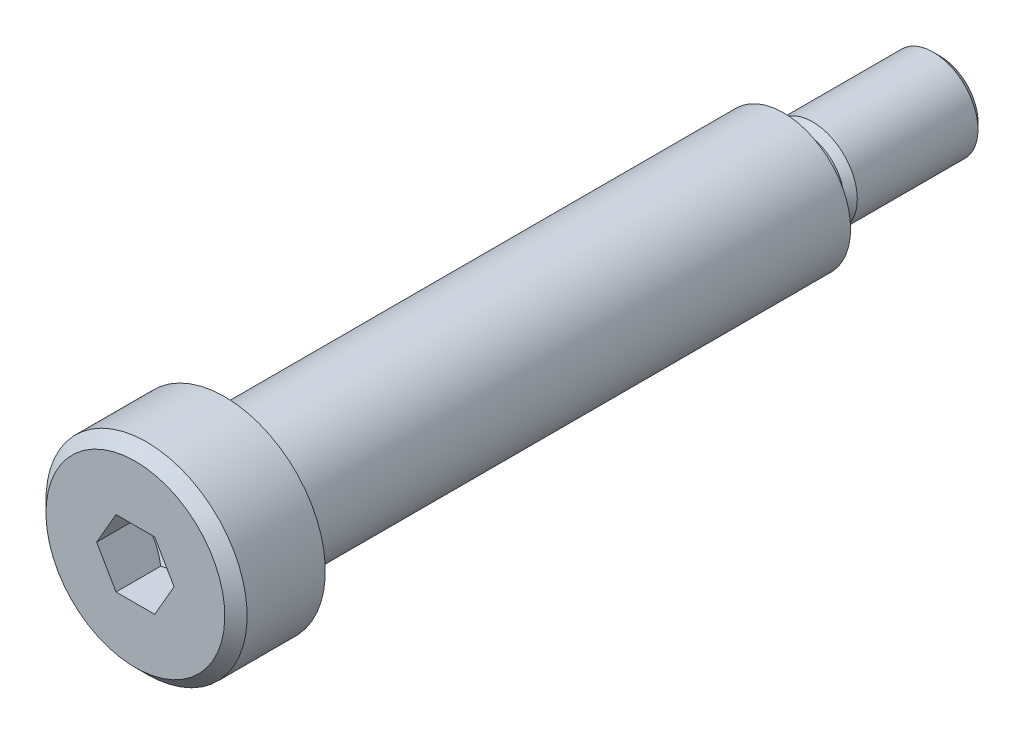
ISO-10303-21;
HEADER;
FILE_DESCRIPTION(('STEP AP214'),'2;1');
FILE_NAME('part.step','',(''),(''),'','','');
FILE_SCHEMA(('AUTOMOTIVE_DESIGN { 1 0 10303 214 1 1 1 1 }'));
ENDSEC;
DATA;
#1=APPLICATION_CONTEXT('core data for automotive mechanical design processes');
#2=APPLICATION_PROTOCOL_DEFINITION('international standard','automotive_design',2000,#1);
#3=PRODUCT_CONTEXT('',#1,'mechanical');
#4=PRODUCT('Part','Part','',(#3));
#5=PRODUCT_RELATED_PRODUCT_CATEGORY('part','',(#4));
#6=PRODUCT_DEFINITION_FORMATION('','',#4);
#7=PRODUCT_DEFINITION_CONTEXT('part definition',#1,'design');
#8=PRODUCT_DEFINITION('design','',#6,#7);
#9=PRODUCT_DEFINITION_SHAPE('','',#8);
#10=(LENGTH_UNIT() NAMED_UNIT(*) SI_UNIT(.MILLI.,.METRE.));
#11=(NAMED_UNIT(*) PLANE_ANGLE_UNIT() SI_UNIT($,.RADIAN.));
#12=(NAMED_UNIT(*) SI_UNIT($,.STERADIAN.) SOLID_ANGLE_UNIT());
#13=UNCERTAINTY_MEASURE_WITH_UNIT(LENGTH_MEASURE(1.E-05),#10,'distance_accuracy_value','');
#14=(GEOMETRIC_REPRESENTATION_CONTEXT(3) GLOBAL_UNCERTAINTY_ASSIGNED_CONTEXT((#13)) GLOBAL_UNIT_ASSIGNED_CONTEXT((#10,
#11,#12)) REPRESENTATION_CONTEXT('',''));
#15=CARTESIAN_POINT('',(0.,0.,0.));
#16=DIRECTION('',(0.,0.,1.));
#17=DIRECTION('',(1.,0.,0.));
#18=AXIS2_PLACEMENT_3D('',#15,#16,#17);
#19=CARTESIAN_POINT('',(0.,0.,25.));
#20=DIRECTION('',(0.,0.,-1.));
#21=DIRECTION('',(0.,-1.,0.));
#22=AXIS2_PLACEMENT_3D('',#19,#20,#21);
#23=PLANE('',#22);
#24=CARTESIAN_POINT('',(0.,0.,25.));
#25=DIRECTION('',(0.,0.,1.));
#26=DIRECTION('',(1.,0.,0.));
#27=AXIS2_PLACEMENT_3D('',#24,#25,#26);
#28=CIRCLE('',#27,3.);
#29=CARTESIAN_POINT('',(3.,0.,25.));
#30=VERTEX_POINT('',#29);
#31=EDGE_CURVE('E175',#30,#30,#28,.T.);
#32=ORIENTED_EDGE('',*,*,#31,.T.);
#33=EDGE_LOOP('',(#32));
#34=FACE_BOUND('',#33,.T.);
#35=CARTESIAN_POINT('',(0.,0.,25.));
#36=DIRECTION('',(0.,0.,-1.));
#37=DIRECTION('',(0.,1.,0.));
#38=AXIS2_PLACEMENT_3D('',#35,#36,#37);
#39=CIRCLE('',#38,4.5);
#40=CARTESIAN_POINT('',(0.,4.5,25.));
#41=VERTEX_POINT('',#40);
#42=EDGE_CURVE('E10',#41,#41,#39,.T.);
#43=ORIENTED_EDGE('',*,*,#42,.T.);
#44=EDGE_LOOP('',(#43));
#45=FACE_BOUND('',#44,.T.);
#46=ADVANCED_FACE('F16',(#34,#45),#23,.T.);
#47=CARTESIAN_POINT('',(0.,0.,29.));
#48=DIRECTION('',(0.,0.,1.));
#49=DIRECTION('',(0.,-1.,0.));
#50=AXIS2_PLACEMENT_3D('',#47,#48,#49);
#51=PLANE('',#50);
#52=DIRECTION('',(-1.,0.,0.));
#53=VECTOR('',#52,1.);
#54=CARTESIAN_POINT('',(0.,-1.5,29.));
#55=LINE('',#54,#53);
#56=CARTESIAN_POINT('',(0.866025403784437,-1.5,29.));
#57=VERTEX_POINT('',#56);
#58=CARTESIAN_POINT('',(-0.866025403784438,-1.5,29.));
#59=VERTEX_POINT('',#58);
#60=EDGE_CURVE('E146',#57,#59,#55,.T.);
#61=ORIENTED_EDGE('',*,*,#60,.T.);
#62=DIRECTION('',(-0.5,0.866025403784439,0.));
#63=VECTOR('',#62,1.);
#64=CARTESIAN_POINT('',(-1.29903810567666,-0.75,29.));
#65=LINE('',#64,#63);
#66=CARTESIAN_POINT('',(-1.73205080756888,0.,29.));
#67=VERTEX_POINT('',#66);
#68=EDGE_CURVE('E151',#59,#67,#65,.T.);
#69=ORIENTED_EDGE('',*,*,#68,.T.);
#70=DIRECTION('',(0.5,0.866025403784438,0.));
#71=VECTOR('',#70,1.);
#72=CARTESIAN_POINT('',(-1.29903810567666,0.75,29.));
#73=LINE('',#72,#71);
#74=CARTESIAN_POINT('',(-0.866025403784437,1.5,29.));
#75=VERTEX_POINT('',#74);
#76=EDGE_CURVE('E152',#67,#75,#73,.T.);
#77=ORIENTED_EDGE('',*,*,#76,.T.);
#78=DIRECTION('',(1.,0.,0.));
#79=VECTOR('',#78,1.);
#80=CARTESIAN_POINT('',(0.,1.5,29.));
#81=LINE('',#80,#79);
#82=CARTESIAN_POINT('',(0.866025403784441,1.5,29.));
#83=VERTEX_POINT('',#82);
#84=EDGE_CURVE('E238',#75,#83,#81,.T.);
#85=ORIENTED_EDGE('',*,*,#84,.T.);
#86=DIRECTION('',(0.5,-0.866025403784439,0.));
#87=VECTOR('',#86,1.);
#88=CARTESIAN_POINT('',(1.29903810567666,0.75,29.));
#89=LINE('',#88,#87);
#90=CARTESIAN_POINT('',(1.73205080756888,0.,29.));
#91=VERTEX_POINT('',#90);
#92=EDGE_CURVE('E229',#83,#91,#89,.T.);
#93=ORIENTED_EDGE('',*,*,#92,.T.);
#94=DIRECTION('',(-0.5,-0.866025403784438,0.));
#95=VECTOR('',#94,1.);
#96=CARTESIAN_POINT('',(1.29903810567666,-0.75,29.));
#97=LINE('',#96,#95);
#98=EDGE_CURVE('E220',#91,#57,#97,.T.);
#99=ORIENTED_EDGE('',*,*,#98,.T.);
#100=EDGE_LOOP('',(#61,#69,#77,#85,#93,#99));
#101=FACE_BOUND('',#100,.T.);
#102=CARTESIAN_POINT('',(0.,0.,29.));
#103=DIRECTION('',(0.,0.,-1.));
#104=DIRECTION('',(0.,-1.,0.));
#105=AXIS2_PLACEMENT_3D('',#102,#103,#104);
#106=CIRCLE('',#105,4.);
#107=CARTESIAN_POINT('',(0.,4.,29.));
#108=VERTEX_POINT('',#107);
#109=EDGE_CURVE('E24',#108,#108,#106,.T.);
#110=ORIENTED_EDGE('',*,*,#109,.F.);
#111=EDGE_LOOP('',(#110));
#112=FACE_BOUND('',#111,.T.);
#113=ADVANCED_FACE('F354',(#101,#112),#51,.T.);
#114=CARTESIAN_POINT('',(0.,0.,27.));
#115=DIRECTION('',(0.,0.,-1.));
#116=DIRECTION('',(0.,1.,0.));
#117=AXIS2_PLACEMENT_3D('',#114,#115,#116);
#118=CYLINDRICAL_SURFACE('',#117,4.5);
#119=CARTESIAN_POINT('',(0.,0.,28.5));
#120=DIRECTION('',(0.,0.,1.));
#121=DIRECTION('',(0.,-1.,0.));
#122=AXIS2_PLACEMENT_3D('',#119,#120,#121);
#123=CIRCLE('',#122,4.5);
#124=CARTESIAN_POINT('',(0.,4.5,28.5));
#125=VERTEX_POINT('',#124);
#126=EDGE_CURVE('E221',#125,#125,#123,.T.);
#127=ORIENTED_EDGE('',*,*,#126,.F.);
#128=EDGE_LOOP('',(#127));
#129=FACE_BOUND('',#128,.T.);
#130=ORIENTED_EDGE('',*,*,#42,.F.);
#131=EDGE_LOOP('',(#130));
#132=FACE_BOUND('',#131,.T.);
#133=ADVANCED_FACE('F385',(#129,#132),#118,.T.);
#134=CARTESIAN_POINT('',(0.,0.,29.));
#135=DIRECTION('',(0.,0.,-1.));
#136=DIRECTION('',(0.,-1.,0.));
#137=AXIS2_PLACEMENT_3D('',#134,#135,#136);
#138=CONICAL_SURFACE('',#137,4.,0.785398163397448);
#139=ORIENTED_EDGE('',*,*,#109,.T.);
#140=EDGE_LOOP('',(#139));
#141=FACE_BOUND('',#140,.T.);
#142=ORIENTED_EDGE('',*,*,#126,.T.);
#143=EDGE_LOOP('',(#142));
#144=FACE_BOUND('',#143,.T.);
#145=ADVANCED_FACE('F412',(#141,#144),#138,.T.);
#146=CARTESIAN_POINT('',(-1.29903810567666,-0.75,29.));
#147=DIRECTION('',(-0.866025403784439,-0.5,0.));
#148=DIRECTION('',(-0.5,0.866025403784439,0.));
#149=AXIS2_PLACEMENT_3D('',#146,#147,#148);
#150=PLANE('',#149);
#151=DIRECTION('',(0.,0.,-1.));
#152=VECTOR('',#151,1.);
#153=CARTESIAN_POINT('',(-1.73205080756888,0.,29.));
#154=LINE('',#153,#152);
#155=CARTESIAN_POINT('',(-1.73205080756888,0.,27.));
#156=VERTEX_POINT('',#155);
#157=EDGE_CURVE('E148',#67,#156,#154,.T.);
#158=ORIENTED_EDGE('',*,*,#157,.F.);
#159=ORIENTED_EDGE('',*,*,#68,.F.);
#160=DIRECTION('',(0.,0.,-1.));
#161=VECTOR('',#160,1.);
#162=CARTESIAN_POINT('',(-0.866025403784438,-1.5,29.));
#163=LINE('',#162,#161);
#164=CARTESIAN_POINT('',(-0.866025403784438,-1.5,27.));
#165=VERTEX_POINT('',#164);
#166=EDGE_CURVE('E143',#59,#165,#163,.T.);
#167=ORIENTED_EDGE('',*,*,#166,.T.);
#168=CARTESIAN_POINT('',(-0.866025403784438,-1.5,27.));
#169=CARTESIAN_POINT('',(-1.29903810567666,-0.750000000000001,26.7398197198942));
#170=CARTESIAN_POINT('',(-1.73205080756888,0.,27.));
#171=(BOUNDED_CURVE() B_SPLINE_CURVE(2,(#168,#169,#170),.UNSPECIFIED.,.F.,
.F.) B_SPLINE_CURVE_WITH_KNOTS((3,3),(0.,1.75435546957641),
.UNSPECIFIED.) CURVE() GEOMETRIC_REPRESENTATION_ITEM() RATIONAL_B_SPLINE_CURVE((1.,
1.15470053837925,1.)) REPRESENTATION_ITEM(''));
#172=EDGE_CURVE('E172',#165,#156,#171,.T.);
#173=ORIENTED_EDGE('',*,*,#172,.T.);
#174=EDGE_LOOP('',(#158,#159,#167,#173));
#175=FACE_BOUND('',#174,.T.);
#176=ADVANCED_FACE('F360',(#175),#150,.F.);
#177=CARTESIAN_POINT('',(-1.29903810567666,0.75,29.));
#178=DIRECTION('',(-0.866025403784438,0.5,0.));
#179=DIRECTION('',(0.,0.,1.));
#180=AXIS2_PLACEMENT_3D('',#177,#178,#179);
#181=PLANE('',#180);
#182=DIRECTION('',(0.,0.,-1.));
#183=VECTOR('',#182,1.);
#184=CARTESIAN_POINT('',(-0.866025403784437,1.5,29.));
#185=LINE('',#184,#183);
#186=CARTESIAN_POINT('',(-0.866025403784437,1.5,27.));
#187=VERTEX_POINT('',#186);
#188=EDGE_CURVE('E235',#75,#187,#185,.T.);
#189=ORIENTED_EDGE('',*,*,#188,.F.);
#190=ORIENTED_EDGE('',*,*,#76,.F.);
#191=ORIENTED_EDGE('',*,*,#157,.T.);
#192=CARTESIAN_POINT('',(-1.73205080756888,0.,27.));
#193=CARTESIAN_POINT('',(-1.29903810567666,0.750000000000001,26.7398197198942));
#194=CARTESIAN_POINT('',(-0.866025403784439,1.5,27.));
#195=(BOUNDED_CURVE() B_SPLINE_CURVE(2,(#192,#193,#194),.UNSPECIFIED.,.F.,
.F.) B_SPLINE_CURVE_WITH_KNOTS((3,3),(0.,1.7543554695764),
.UNSPECIFIED.) CURVE() GEOMETRIC_REPRESENTATION_ITEM() RATIONAL_B_SPLINE_CURVE((1.,
1.15470053837925,1.)) REPRESENTATION_ITEM(''));
#196=EDGE_CURVE('E139',#156,#187,#195,.T.);
#197=ORIENTED_EDGE('',*,*,#196,.T.);
#198=EDGE_LOOP('',(#189,#190,#191,#197));
#199=FACE_BOUND('',#198,.T.);
#200=ADVANCED_FACE('F339',(#199),#181,.F.);
#201=CARTESIAN_POINT('',(0.,1.5,29.));
#202=DIRECTION('',(0.,1.,0.));
#203=DIRECTION('',(1.,0.,0.));
#204=AXIS2_PLACEMENT_3D('',#201,#202,#203);
#205=PLANE('',#204);
#206=DIRECTION('',(0.,0.,-1.));
#207=VECTOR('',#206,1.);
#208=CARTESIAN_POINT('',(0.866025403784441,1.5,29.));
#209=LINE('',#208,#207);
#210=CARTESIAN_POINT('',(0.866025403784441,1.5,27.));
#211=VERTEX_POINT('',#210);
#212=EDGE_CURVE('E232',#83,#211,#209,.T.);
#213=ORIENTED_EDGE('',*,*,#212,.F.);
#214=ORIENTED_EDGE('',*,*,#84,.F.);
#215=ORIENTED_EDGE('',*,*,#188,.T.);
#216=CARTESIAN_POINT('',(-0.866025403784437,1.5,27.));
#217=CARTESIAN_POINT('',(0.,1.5,26.7398197198942));
#218=CARTESIAN_POINT('',(0.86602540378444,1.5,27.));
#219=(BOUNDED_CURVE() B_SPLINE_CURVE(2,(#216,#217,#218),.UNSPECIFIED.,.F.,
.F.) B_SPLINE_CURVE_WITH_KNOTS((3,3),(0.,1.75435546957641),
.UNSPECIFIED.) CURVE() GEOMETRIC_REPRESENTATION_ITEM() RATIONAL_B_SPLINE_CURVE((1.,
1.15470053837925,1.)) REPRESENTATION_ITEM(''));
#220=EDGE_CURVE('E198',#187,#211,#219,.T.);
#221=ORIENTED_EDGE('',*,*,#220,.T.);
#222=EDGE_LOOP('',(#213,#214,#215,#221));
#223=FACE_BOUND('',#222,.T.);
#224=ADVANCED_FACE('F351',(#223),#205,.F.);
#225=CARTESIAN_POINT('',(1.29903810567666,0.75,29.));
#226=DIRECTION('',(0.866025403784439,0.5,0.));
#227=DIRECTION('',(0.,0.,-1.));
#228=AXIS2_PLACEMENT_3D('',#225,#226,#227);
#229=PLANE('',#228);
#230=DIRECTION('',(0.,0.,-1.));
#231=VECTOR('',#230,1.);
#232=CARTESIAN_POINT('',(1.73205080756888,0.,29.));
#233=LINE('',#232,#231);
#234=CARTESIAN_POINT('',(1.73205080756888,0.,27.));
#235=VERTEX_POINT('',#234);
#236=EDGE_CURVE('E226',#91,#235,#233,.T.);
#237=ORIENTED_EDGE('',*,*,#236,.F.);
#238=ORIENTED_EDGE('',*,*,#92,.F.);
#239=ORIENTED_EDGE('',*,*,#212,.T.);
#240=CARTESIAN_POINT('',(0.866025403784441,1.5,27.));
#241=CARTESIAN_POINT('',(1.29903810567665,0.749999999999998,26.7398197198942));
#242=CARTESIAN_POINT('',(1.73205080756888,0.,27.));
#243=(BOUNDED_CURVE() B_SPLINE_CURVE(2,(#240,#241,#242),.UNSPECIFIED.,.F.,
.F.) B_SPLINE_CURVE_WITH_KNOTS((3,3),(0.,1.7543554695764),
.UNSPECIFIED.) CURVE() GEOMETRIC_REPRESENTATION_ITEM() RATIONAL_B_SPLINE_CURVE((1.,
1.15470053837926,1.)) REPRESENTATION_ITEM(''));
#244=EDGE_CURVE('E192',#211,#235,#243,.T.);
#245=ORIENTED_EDGE('',*,*,#244,.T.);
#246=EDGE_LOOP('',(#237,#238,#239,#245));
#247=FACE_BOUND('',#246,.T.);
#248=ADVANCED_FACE('F368',(#247),#229,.F.);
#249=CARTESIAN_POINT('',(1.29903810567666,-0.75,29.));
#250=DIRECTION('',(0.866025403784438,-0.5,0.));
#251=DIRECTION('',(0.,0.,-1.));
#252=AXIS2_PLACEMENT_3D('',#249,#250,#251);
#253=PLANE('',#252);
#254=DIRECTION('',(0.,0.,-1.));
#255=VECTOR('',#254,1.);
#256=CARTESIAN_POINT('',(0.866025403784437,-1.5,29.));
#257=LINE('',#256,#255);
#258=CARTESIAN_POINT('',(0.866025403784437,-1.5,27.));
#259=VERTEX_POINT('',#258);
#260=EDGE_CURVE('E189',#57,#259,#257,.T.);
#261=ORIENTED_EDGE('',*,*,#260,.F.);
#262=ORIENTED_EDGE('',*,*,#98,.F.);
#263=ORIENTED_EDGE('',*,*,#236,.T.);
#264=CARTESIAN_POINT('',(1.73205080756888,0.,27.));
#265=CARTESIAN_POINT('',(1.29903810567666,-0.750000000000002,26.7398197198942));
#266=CARTESIAN_POINT('',(0.866025403784438,-1.5,27.));
#267=(BOUNDED_CURVE() B_SPLINE_CURVE(2,(#264,#265,#266),.UNSPECIFIED.,.F.,
.F.) B_SPLINE_CURVE_WITH_KNOTS((3,3),(0.,1.7543554695764),
.UNSPECIFIED.) CURVE() GEOMETRIC_REPRESENTATION_ITEM() RATIONAL_B_SPLINE_CURVE((1.,
1.15470053837925,1.)) REPRESENTATION_ITEM(''));
#268=EDGE_CURVE('E162',#235,#259,#267,.T.);
#269=ORIENTED_EDGE('',*,*,#268,.T.);
#270=EDGE_LOOP('',(#261,#262,#263,#269));
#271=FACE_BOUND('',#270,.T.);
#272=ADVANCED_FACE('F366',(#271),#253,.F.);
#273=CARTESIAN_POINT('',(0.,-1.5,29.));
#274=DIRECTION('',(0.,-1.,0.));
#275=DIRECTION('',(-1.,0.,0.));
#276=AXIS2_PLACEMENT_3D('',#273,#274,#275);
#277=PLANE('',#276);
#278=ORIENTED_EDGE('',*,*,#166,.F.);
#279=ORIENTED_EDGE('',*,*,#60,.F.);
#280=ORIENTED_EDGE('',*,*,#260,.T.);
#281=CARTESIAN_POINT('',(0.866025403784437,-1.5,27.));
#282=CARTESIAN_POINT('',(0.,-1.5,26.7398197198942));
#283=CARTESIAN_POINT('',(-0.866025403784439,-1.5,27.));
#284=(BOUNDED_CURVE() B_SPLINE_CURVE(2,(#281,#282,#283),.UNSPECIFIED.,.F.,
.F.) B_SPLINE_CURVE_WITH_KNOTS((3,3),(0.,1.7543554695764),
.UNSPECIFIED.) CURVE() GEOMETRIC_REPRESENTATION_ITEM() RATIONAL_B_SPLINE_CURVE((1.,
1.15470053837925,1.)) REPRESENTATION_ITEM(''));
#285=EDGE_CURVE('E156',#259,#165,#284,.T.);
#286=ORIENTED_EDGE('',*,*,#285,.T.);
#287=EDGE_LOOP('',(#278,#279,#280,#286));
#288=FACE_BOUND('',#287,.T.);
#289=ADVANCED_FACE('F362',(#288),#277,.F.);
#290=CARTESIAN_POINT('',(0.,0.,25.969278879577));
#291=DIRECTION('',(0.,0.,-1.));
#292=DIRECTION('',(0.,-1.,0.));
#293=AXIS2_PLACEMENT_3D('',#290,#291,#292);
#294=PLANE('',#293);
#295=CARTESIAN_POINT('',(0.,0.,25.969278879577));
#296=DIRECTION('',(0.,0.,-1.));
#297=DIRECTION('',(1.,0.,0.));
#298=AXIS2_PLACEMENT_3D('',#295,#296,#297);
#299=CIRCLE('',#298,0.0166427948235053);
#300=CARTESIAN_POINT('',(0.0166427948235053,0.,25.969278879577));
#301=VERTEX_POINT('',#300);
#302=EDGE_CURVE('E147',#301,#301,#299,.T.);
#303=ORIENTED_EDGE('',*,*,#302,.F.);
#304=EDGE_LOOP('',(#303));
#305=FACE_BOUND('',#304,.T.);
#306=ADVANCED_FACE('F469',(#305),#294,.F.);
#307=CARTESIAN_POINT('',(0.,0.,26.4846394397885));
#308=DIRECTION('',(0.,0.,1.));
#309=DIRECTION('',(1.,0.,0.));
#310=AXIS2_PLACEMENT_3D('',#307,#308,#309);
#311=CONICAL_SURFACE('',#310,0.874346801196191,1.02974425867665);
#312=ORIENTED_EDGE('',*,*,#302,.T.);
#313=EDGE_LOOP('',(#312));
#314=FACE_BOUND('',#313,.T.);
#315=ORIENTED_EDGE('',*,*,#285,.F.);
#316=ORIENTED_EDGE('',*,*,#268,.F.);
#317=ORIENTED_EDGE('',*,*,#244,.F.);
#318=ORIENTED_EDGE('',*,*,#220,.F.);
#319=ORIENTED_EDGE('',*,*,#196,.F.);
#320=ORIENTED_EDGE('',*,*,#172,.F.);
#321=EDGE_LOOP('',(#315,#316,#317,#318,#319,#320));
#322=FACE_BOUND('',#321,.T.);
#323=ADVANCED_FACE('F347',(#314,#322),#311,.F.);
#324=CARTESIAN_POINT('',(0.,0.,0.));
#325=DIRECTION('',(0.,0.,-1.));
#326=DIRECTION('',(0.,-1.,0.));
#327=AXIS2_PLACEMENT_3D('',#324,#325,#326);
#328=PLANE('',#327);
#329=CARTESIAN_POINT('',(0.,0.,0.));
#330=DIRECTION('',(0.,0.,-1.));
#331=DIRECTION('',(1.,0.,0.));
#332=AXIS2_PLACEMENT_3D('',#329,#330,#331);
#333=CIRCLE('',#332,1.7);
#334=CARTESIAN_POINT('',(1.7,0.,0.));
#335=VERTEX_POINT('',#334);
#336=EDGE_CURVE('E169',#335,#335,#333,.T.);
#337=ORIENTED_EDGE('',*,*,#336,.F.);
#338=EDGE_LOOP('',(#337));
#339=FACE_BOUND('',#338,.T.);
#340=CARTESIAN_POINT('',(0.,0.,0.));
#341=DIRECTION('',(0.,0.,-1.));
#342=DIRECTION('',(1.,0.,0.));
#343=AXIS2_PLACEMENT_3D('',#340,#341,#342);
#344=CIRCLE('',#343,3.);
#345=CARTESIAN_POINT('',(3.,0.,0.));
#346=VERTEX_POINT('',#345);
#347=EDGE_CURVE('E163',#346,#346,#344,.T.);
#348=ORIENTED_EDGE('',*,*,#347,.T.);
#349=EDGE_LOOP('',(#348));
#350=FACE_BOUND('',#349,.T.);
#351=ADVANCED_FACE('F390',(#339,#350),#328,.T.);
#352=CARTESIAN_POINT('',(0.,0.,12.5));
#353=DIRECTION('',(0.,0.,-1.));
#354=DIRECTION('',(1.,0.,0.));
#355=AXIS2_PLACEMENT_3D('',#352,#353,#354);
#356=CYLINDRICAL_SURFACE('',#355,3.);
#357=ORIENTED_EDGE('',*,*,#347,.F.);
#358=EDGE_LOOP('',(#357));
#359=FACE_BOUND('',#358,.T.);
#360=ORIENTED_EDGE('',*,*,#31,.F.);
#361=EDGE_LOOP('',(#360));
#362=FACE_BOUND('',#361,.T.);
#363=ADVANCED_FACE('F388',(#359,#362),#356,.T.);
#364=CARTESIAN_POINT('',(0.,0.,-0.5));
#365=DIRECTION('',(0.,0.,-1.));
#366=DIRECTION('',(1.,0.,0.));
#367=AXIS2_PLACEMENT_3D('',#364,#365,#366);
#368=CYLINDRICAL_SURFACE('',#367,1.7);
#369=CARTESIAN_POINT('',(0.,0.,-1.));
#370=DIRECTION('',(0.,0.,1.));
#371=DIRECTION('',(1.,0.,0.));
#372=AXIS2_PLACEMENT_3D('',#369,#370,#371);
#373=CIRCLE('',#372,1.7);
#374=CARTESIAN_POINT('',(1.7,0.,-1.));
#375=VERTEX_POINT('',#374);
#376=EDGE_CURVE('E125',#375,#375,#373,.T.);
#377=ORIENTED_EDGE('',*,*,#376,.T.);
#378=EDGE_LOOP('',(#377));
#379=FACE_BOUND('',#378,.T.);
#380=ORIENTED_EDGE('',*,*,#336,.T.);
#381=EDGE_LOOP('',(#380));
#382=FACE_BOUND('',#381,.T.);
#383=ADVANCED_FACE('F126',(#379,#382),#368,.T.);
#384=CARTESIAN_POINT('',(0.,0.,-7.));
#385=DIRECTION('',(0.,0.,-1.));
#386=DIRECTION('',(0.,-1.,0.));
#387=AXIS2_PLACEMENT_3D('',#384,#385,#386);
#388=PLANE('',#387);
#389=CARTESIAN_POINT('',(0.,0.,-7.));
#390=DIRECTION('',(0.,0.,1.));
#391=DIRECTION('',(-1.,0.,0.));
#392=AXIS2_PLACEMENT_3D('',#389,#390,#391);
#393=CIRCLE('',#392,1.7);
#394=CARTESIAN_POINT('',(1.7,0.,-7.));
#395=VERTEX_POINT('',#394);
#396=EDGE_CURVE('E155',#395,#395,#393,.T.);
#397=ORIENTED_EDGE('',*,*,#396,.F.);
#398=EDGE_LOOP('',(#397));
#399=FACE_BOUND('',#398,.T.);
#400=ADVANCED_FACE('F397',(#399),#388,.T.);
#401=CARTESIAN_POINT('',(0.,0.,-3.5));
#402=DIRECTION('',(0.,0.,-1.));
#403=DIRECTION('',(1.,0.,0.));
#404=AXIS2_PLACEMENT_3D('',#401,#402,#403);
#405=CYLINDRICAL_SURFACE('',#404,2.);
#406=CARTESIAN_POINT('',(0.,0.,-1.3));
#407=DIRECTION('',(0.,0.,1.));
#408=DIRECTION('',(-1.,0.,0.));
#409=AXIS2_PLACEMENT_3D('',#406,#407,#408);
#410=CIRCLE('',#409,2.);
#411=CARTESIAN_POINT('',(2.,0.,-1.3));
#412=VERTEX_POINT('',#411);
#413=EDGE_CURVE('E130',#412,#412,#410,.T.);
#414=ORIENTED_EDGE('',*,*,#413,.F.);
#415=EDGE_LOOP('',(#414));
#416=FACE_BOUND('',#415,.T.);
#417=CARTESIAN_POINT('',(0.,0.,-6.7));
#418=DIRECTION('',(0.,0.,-1.));
#419=DIRECTION('',(-1.,0.,0.));
#420=AXIS2_PLACEMENT_3D('',#417,#418,#419);
#421=CIRCLE('',#420,2.);
#422=CARTESIAN_POINT('',(2.,0.,-6.7));
#423=VERTEX_POINT('',#422);
#424=EDGE_CURVE('E136',#423,#423,#421,.T.);
#425=ORIENTED_EDGE('',*,*,#424,.F.);
#426=EDGE_LOOP('',(#425));
#427=FACE_BOUND('',#426,.T.);
#428=ADVANCED_FACE('F404',(#416,#427),#405,.T.);
#429=CARTESIAN_POINT('',(0.,0.,-7.));
#430=DIRECTION('',(0.,0.,1.));
#431=DIRECTION('',(-1.,0.,0.));
#432=AXIS2_PLACEMENT_3D('',#429,#430,#431);
#433=CONICAL_SURFACE('',#432,1.7,0.785398163397448);
#434=ORIENTED_EDGE('',*,*,#396,.T.);
#435=EDGE_LOOP('',(#434));
#436=FACE_BOUND('',#435,.T.);
#437=ORIENTED_EDGE('',*,*,#424,.T.);
#438=EDGE_LOOP('',(#437));
#439=FACE_BOUND('',#438,.T.);
#440=ADVANCED_FACE('F408',(#436,#439),#433,.T.);
#441=CARTESIAN_POINT('',(0.,0.,-1.));
#442=DIRECTION('',(0.,0.,-1.));
#443=DIRECTION('',(-1.,0.,0.));
#444=AXIS2_PLACEMENT_3D('',#441,#442,#443);
#445=CONICAL_SURFACE('',#444,1.7,0.785398163397448);
#446=ORIENTED_EDGE('',*,*,#413,.T.);
#447=EDGE_LOOP('',(#446));
#448=FACE_BOUND('',#447,.T.);
#449=ORIENTED_EDGE('',*,*,#376,.F.);
#450=EDGE_LOOP('',(#449));
#451=FACE_BOUND('',#450,.T.);
#452=ADVANCED_FACE('F417',(#448,#451),#445,.T.);
#453=CLOSED_SHELL('',(#46,#113,#133,#145,#176,#200,#224,#248,#272,#289,#306,#323,#351,#363,#383,
#400,#428,#440,#452));
#454=MANIFOLD_SOLID_BREP('B1',#453);
#455=ADVANCED_BREP_SHAPE_REPRESENTATION('',(#18,#454),#14);
#456=SHAPE_DEFINITION_REPRESENTATION(#9,#455);
ENDSEC;
END-ISO-10303-21;
